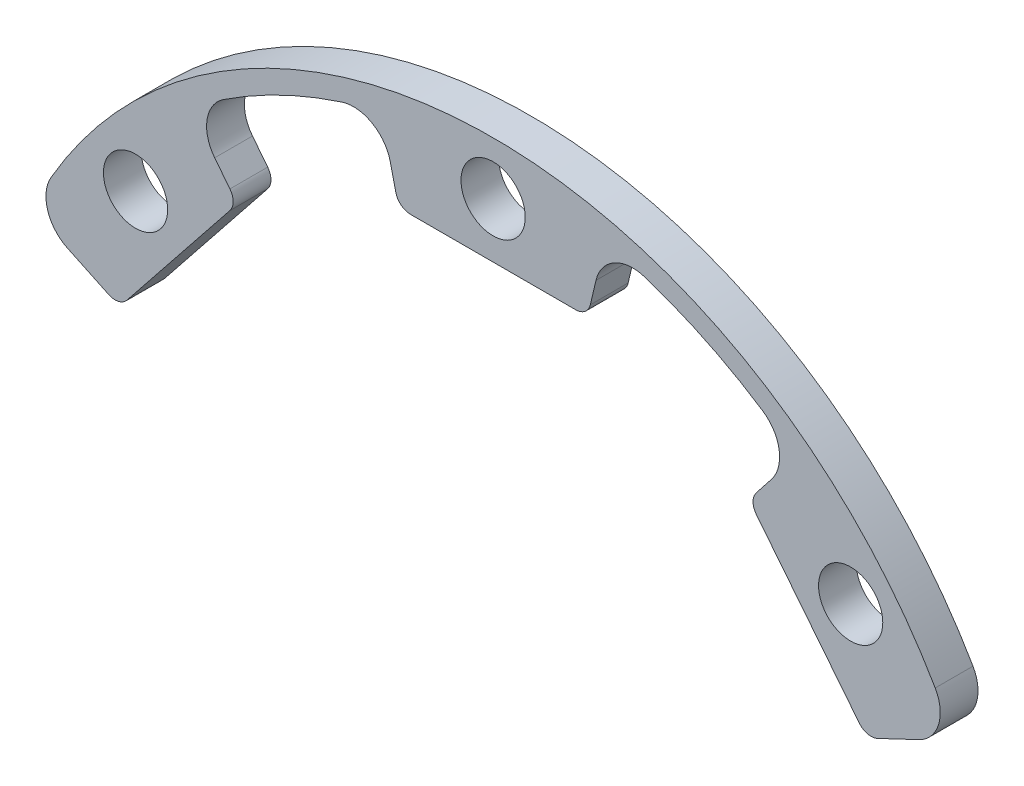
ISO-10303-21;
HEADER;
FILE_DESCRIPTION(('STEP AP214'),'2;1');
FILE_NAME('part.step','',(''),(''),'','','');
FILE_SCHEMA(('AUTOMOTIVE_DESIGN { 1 0 10303 214 1 1 1 1 }'));
ENDSEC;
DATA;
#1=APPLICATION_CONTEXT('core data for automotive mechanical design processes');
#2=APPLICATION_PROTOCOL_DEFINITION('international standard','automotive_design',2000,#1);
#3=PRODUCT_CONTEXT('',#1,'mechanical');
#4=PRODUCT('Part','Part','',(#3));
#5=PRODUCT_RELATED_PRODUCT_CATEGORY('part','',(#4));
#6=PRODUCT_DEFINITION_FORMATION('','',#4);
#7=PRODUCT_DEFINITION_CONTEXT('part definition',#1,'design');
#8=PRODUCT_DEFINITION('design','',#6,#7);
#9=PRODUCT_DEFINITION_SHAPE('','',#8);
#10=(LENGTH_UNIT() NAMED_UNIT(*) SI_UNIT(.MILLI.,.METRE.));
#11=(NAMED_UNIT(*) PLANE_ANGLE_UNIT() SI_UNIT($,.RADIAN.));
#12=(NAMED_UNIT(*) SI_UNIT($,.STERADIAN.) SOLID_ANGLE_UNIT());
#13=UNCERTAINTY_MEASURE_WITH_UNIT(LENGTH_MEASURE(1.E-05),#10,'distance_accuracy_value','');
#14=(GEOMETRIC_REPRESENTATION_CONTEXT(3) GLOBAL_UNCERTAINTY_ASSIGNED_CONTEXT((#13)) GLOBAL_UNIT_ASSIGNED_CONTEXT((#10,
#11,#12)) REPRESENTATION_CONTEXT('',''));
#15=CARTESIAN_POINT('',(0.,0.,0.));
#16=DIRECTION('',(0.,0.,1.));
#17=DIRECTION('',(1.,0.,0.));
#18=AXIS2_PLACEMENT_3D('',#15,#16,#17);
#19=CARTESIAN_POINT('',(0.,0.,5.));
#20=DIRECTION('',(0.,0.,-1.));
#21=DIRECTION('',(-1.,0.,0.));
#22=AXIS2_PLACEMENT_3D('',#19,#20,#21);
#23=CYLINDRICAL_SURFACE('',#22,67.5);
#24=CARTESIAN_POINT('',(0.,0.,5.));
#25=DIRECTION('',(0.,0.,1.));
#26=DIRECTION('',(1.,0.,0.));
#27=AXIS2_PLACEMENT_3D('',#24,#25,#26);
#28=CIRCLE('',#27,67.5);
#29=CARTESIAN_POINT('',(-58.4869884798943,33.6975099755562,5.));
#30=VERTEX_POINT('',#29);
#31=CARTESIAN_POINT('',(58.4869884798943,33.6975099755562,5.));
#32=VERTEX_POINT('',#31);
#33=EDGE_CURVE('E258',#30,#32,#28,.F.);
#34=ORIENTED_EDGE('',*,*,#33,.T.);
#35=DIRECTION('',(0.,0.,-1.));
#36=VECTOR('',#35,1.);
#37=CARTESIAN_POINT('',(58.4869884798943,33.6975099755562,5.));
#38=LINE('',#37,#36);
#39=CARTESIAN_POINT('',(58.4869884798943,33.6975099755562,0.));
#40=VERTEX_POINT('',#39);
#41=EDGE_CURVE('E278',#32,#40,#38,.T.);
#42=ORIENTED_EDGE('',*,*,#41,.T.);
#43=CARTESIAN_POINT('',(0.,0.,0.));
#44=DIRECTION('',(0.,0.,1.));
#45=DIRECTION('',(1.,0.,0.));
#46=AXIS2_PLACEMENT_3D('',#43,#44,#45);
#47=CIRCLE('',#46,67.5);
#48=CARTESIAN_POINT('',(-58.4869884798943,33.6975099755562,0.));
#49=VERTEX_POINT('',#48);
#50=EDGE_CURVE('E384',#49,#40,#47,.F.);
#51=ORIENTED_EDGE('',*,*,#50,.F.);
#52=DIRECTION('',(0.,0.,-1.));
#53=VECTOR('',#52,1.);
#54=CARTESIAN_POINT('',(-58.4869884798943,33.6975099755562,5.));
#55=LINE('',#54,#53);
#56=EDGE_CURVE('E276',#49,#30,#55,.F.);
#57=ORIENTED_EDGE('',*,*,#56,.T.);
#58=EDGE_LOOP('',(#34,#42,#51,#57));
#59=FACE_BOUND('',#58,.T.);
#60=ADVANCED_FACE('F35',(#59),#23,.T.);
#61=CARTESIAN_POINT('',(0.,0.,5.));
#62=DIRECTION('',(-0.428304381921088,-0.903634525915868,0.));
#63=DIRECTION('',(0.903634525915868,-0.428304381921088,0.));
#64=AXIS2_PLACEMENT_3D('',#61,#62,#63);
#65=PLANE('',#64);
#66=DIRECTION('',(-0.903634525915868,0.428304381921088,0.));
#67=VECTOR('',#66,1.);
#68=CARTESIAN_POINT('',(0.,0.,0.));
#69=LINE('',#68,#67);
#70=CARTESIAN_POINT('',(-50.8588287102896,24.1060501466709,0.));
#71=VERTEX_POINT('',#70);
#72=CARTESIAN_POINT('',(-56.2961408724706,26.6832254959356,0.));
#73=VERTEX_POINT('',#72);
#74=EDGE_CURVE('E383',#71,#73,#69,.T.);
#75=ORIENTED_EDGE('',*,*,#74,.F.);
#76=DIRECTION('',(0.,0.,-1.));
#77=VECTOR('',#76,1.);
#78=CARTESIAN_POINT('',(-50.8588287102896,24.1060501466709,5.));
#79=LINE('',#78,#77);
#80=CARTESIAN_POINT('',(-50.8588287102896,24.1060501466709,5.));
#81=VERTEX_POINT('',#80);
#82=EDGE_CURVE('E11',#71,#81,#79,.F.);
#83=ORIENTED_EDGE('',*,*,#82,.T.);
#84=DIRECTION('',(-0.903634525915868,0.428304381921088,0.));
#85=VECTOR('',#84,1.);
#86=CARTESIAN_POINT('',(0.,0.,5.));
#87=LINE('',#86,#85);
#88=CARTESIAN_POINT('',(-56.2961408724706,26.6832254959356,5.));
#89=VERTEX_POINT('',#88);
#90=EDGE_CURVE('E376',#81,#89,#87,.T.);
#91=ORIENTED_EDGE('',*,*,#90,.T.);
#92=DIRECTION('',(0.,0.,-1.));
#93=VECTOR('',#92,1.);
#94=CARTESIAN_POINT('',(-56.2961408724706,26.6832254959356,5.));
#95=LINE('',#94,#93);
#96=EDGE_CURVE('E209',#89,#73,#95,.T.);
#97=ORIENTED_EDGE('',*,*,#96,.T.);
#98=EDGE_LOOP('',(#75,#83,#91,#97));
#99=FACE_BOUND('',#98,.T.);
#100=ADVANCED_FACE('F433',(#99),#65,.T.);
#101=CARTESIAN_POINT('',(-41.6325264414226,33.2008319489776,5.));
#102=DIRECTION('',(-0.78183148246803,0.623489801858734,0.));
#103=DIRECTION('',(-0.623489801858734,-0.78183148246803,0.));
#104=AXIS2_PLACEMENT_3D('',#101,#102,#103);
#105=PLANE('',#104);
#106=DIRECTION('',(0.623489801858734,0.78183148246803,0.));
#107=VECTOR('',#106,1.);
#108=CARTESIAN_POINT('',(-41.6325264414226,33.2008319489776,0.));
#109=LINE('',#108,#107);
#110=CARTESIAN_POINT('',(-48.4385569815114,24.6663395947851,0.));
#111=VERTEX_POINT('',#110);
#112=CARTESIAN_POINT('',(-34.8246984129672,41.737578282289,0.));
#113=VERTEX_POINT('',#112);
#114=EDGE_CURVE('E231',#111,#113,#109,.T.);
#115=ORIENTED_EDGE('',*,*,#114,.T.);
#116=DIRECTION('',(0.,0.,-1.));
#117=VECTOR('',#116,1.);
#118=CARTESIAN_POINT('',(-34.8246984129672,41.737578282289,5.));
#119=LINE('',#118,#117);
#120=CARTESIAN_POINT('',(-34.8246984129672,41.737578282289,5.));
#121=VERTEX_POINT('',#120);
#122=EDGE_CURVE('E43',#113,#121,#119,.F.);
#123=ORIENTED_EDGE('',*,*,#122,.T.);
#124=DIRECTION('',(0.623489801858734,0.78183148246803,0.));
#125=VECTOR('',#124,1.);
#126=CARTESIAN_POINT('',(-41.6325264414226,33.2008319489776,5.));
#127=LINE('',#126,#125);
#128=CARTESIAN_POINT('',(-48.4385569815114,24.6663395947851,5.));
#129=VERTEX_POINT('',#128);
#130=EDGE_CURVE('E364',#129,#121,#127,.T.);
#131=ORIENTED_EDGE('',*,*,#130,.F.);
#132=DIRECTION('',(0.,0.,-1.));
#133=VECTOR('',#132,1.);
#134=CARTESIAN_POINT('',(-48.4385569815114,24.6663395947851,0.));
#135=LINE('',#134,#133);
#136=EDGE_CURVE('E356',#129,#111,#135,.T.);
#137=ORIENTED_EDGE('',*,*,#136,.T.);
#138=EDGE_LOOP('',(#115,#123,#131,#137));
#139=FACE_BOUND('',#138,.T.);
#140=ADVANCED_FACE('F363',(#139),#105,.F.);
#141=CARTESIAN_POINT('',(0.,0.,5.));
#142=DIRECTION('',(-0.785702679283874,-0.618604315993788,0.));
#143=DIRECTION('',(0.618604315993788,-0.785702679283874,0.));
#144=AXIS2_PLACEMENT_3D('',#141,#142,#143);
#145=PLANE('',#144);
#146=DIRECTION('',(-0.618604315993788,0.785702679283874,0.));
#147=VECTOR('',#146,1.);
#148=CARTESIAN_POINT('',(0.,0.,5.));
#149=LINE('',#148,#147);
#150=CARTESIAN_POINT('',(-34.8169560193356,44.2217665179941,5.));
#151=VERTEX_POINT('',#150);
#152=CARTESIAN_POINT('',(-36.8319653918605,46.7810733670444,5.));
#153=VERTEX_POINT('',#152);
#154=EDGE_CURVE('E375',#151,#153,#149,.T.);
#155=ORIENTED_EDGE('',*,*,#154,.F.);
#156=DIRECTION('',(0.,0.,-1.));
#157=VECTOR('',#156,1.);
#158=CARTESIAN_POINT('',(-34.8169560193356,44.2217665179941,5.));
#159=LINE('',#158,#157);
#160=CARTESIAN_POINT('',(-34.8169560193356,44.2217665179941,0.));
#161=VERTEX_POINT('',#160);
#162=EDGE_CURVE('E353',#151,#161,#159,.T.);
#163=ORIENTED_EDGE('',*,*,#162,.T.);
#164=DIRECTION('',(-0.618604315993788,0.785702679283874,0.));
#165=VECTOR('',#164,1.);
#166=CARTESIAN_POINT('',(0.,0.,0.));
#167=LINE('',#166,#165);
#168=CARTESIAN_POINT('',(-36.8319653918605,46.7810733670444,0.));
#169=VERTEX_POINT('',#168);
#170=EDGE_CURVE('E227',#161,#169,#167,.T.);
#171=ORIENTED_EDGE('',*,*,#170,.T.);
#172=DIRECTION('',(0.,0.,1.));
#173=VECTOR('',#172,1.);
#174=CARTESIAN_POINT('',(-36.8319653918605,46.7810733670444,5.));
#175=LINE('',#174,#173);
#176=EDGE_CURVE('E204',#169,#153,#175,.T.);
#177=ORIENTED_EDGE('',*,*,#176,.T.);
#178=EDGE_LOOP('',(#155,#163,#171,#177));
#179=FACE_BOUND('',#178,.T.);
#180=ADVANCED_FACE('F381',(#179),#145,.F.);
#181=CARTESIAN_POINT('',(0.,0.,5.));
#182=DIRECTION('',(0.,0.,-1.));
#183=DIRECTION('',(-1.,0.,0.));
#184=AXIS2_PLACEMENT_3D('',#181,#182,#183);
#185=CYLINDRICAL_SURFACE('',#184,64.75);
#186=CARTESIAN_POINT('',(0.,0.,5.));
#187=DIRECTION('',(0.,0.,1.));
#188=DIRECTION('',(1.,0.,0.));
#189=AXIS2_PLACEMENT_3D('',#186,#187,#188);
#190=CIRCLE('',#189,64.75);
#191=CARTESIAN_POINT('',(-35.6568789406664,54.0476593777257,5.));
#192=VERTEX_POINT('',#191);
#193=CARTESIAN_POINT('',(-20.0244612695975,61.5758349587108,5.));
#194=VERTEX_POINT('',#193);
#195=EDGE_CURVE('E218',#192,#194,#190,.F.);
#196=ORIENTED_EDGE('',*,*,#195,.F.);
#197=DIRECTION('',(0.,0.,-1.));
#198=VECTOR('',#197,1.);
#199=CARTESIAN_POINT('',(-35.6568789406664,54.0476593777257,5.));
#200=LINE('',#199,#198);
#201=CARTESIAN_POINT('',(-35.6568789406664,54.0476593777257,0.));
#202=VERTEX_POINT('',#201);
#203=EDGE_CURVE('E202',#192,#202,#200,.T.);
#204=ORIENTED_EDGE('',*,*,#203,.T.);
#205=CARTESIAN_POINT('',(0.,0.,0.));
#206=DIRECTION('',(0.,0.,1.));
#207=DIRECTION('',(1.,0.,0.));
#208=AXIS2_PLACEMENT_3D('',#205,#206,#207);
#209=CIRCLE('',#208,64.75);
#210=CARTESIAN_POINT('',(-20.0244612695975,61.5758349587108,0.));
#211=VERTEX_POINT('',#210);
#212=EDGE_CURVE('E215',#202,#211,#209,.F.);
#213=ORIENTED_EDGE('',*,*,#212,.T.);
#214=DIRECTION('',(0.,0.,-1.));
#215=VECTOR('',#214,1.);
#216=CARTESIAN_POINT('',(-20.0244612695975,61.5758349587108,5.));
#217=LINE('',#216,#215);
#218=EDGE_CURVE('E219',#211,#194,#217,.F.);
#219=ORIENTED_EDGE('',*,*,#218,.T.);
#220=EDGE_LOOP('',(#196,#204,#213,#219));
#221=FACE_BOUND('',#220,.T.);
#222=ADVANCED_FACE('F214',(#221),#185,.F.);
#223=CARTESIAN_POINT('',(0.,0.,5.));
#224=DIRECTION('',(-0.973521937261123,-0.228593608115689,0.));
#225=DIRECTION('',(0.228593608115689,-0.973521937261123,0.));
#226=AXIS2_PLACEMENT_3D('',#223,#224,#225);
#227=PLANE('',#226);
#228=DIRECTION('',(-0.228593608115689,0.973521937261124,0.));
#229=VECTOR('',#228,1.);
#230=CARTESIAN_POINT('',(0.,0.,0.));
#231=LINE('',#230,#229);
#232=CARTESIAN_POINT('',(-12.8659522642986,54.7928127837686,0.));
#233=VERTEX_POINT('',#232);
#234=CARTESIAN_POINT('',(-13.6105611377631,57.9639122688869,0.));
#235=VERTEX_POINT('',#234);
#236=EDGE_CURVE('E226',#233,#235,#231,.T.);
#237=ORIENTED_EDGE('',*,*,#236,.F.);
#238=DIRECTION('',(0.,0.,-1.));
#239=VECTOR('',#238,1.);
#240=CARTESIAN_POINT('',(-12.8659522642986,54.7928127837686,5.));
#241=LINE('',#240,#239);
#242=CARTESIAN_POINT('',(-12.8659522642986,54.7928127837686,5.));
#243=VERTEX_POINT('',#242);
#244=EDGE_CURVE('E351',#233,#243,#241,.F.);
#245=ORIENTED_EDGE('',*,*,#244,.T.);
#246=DIRECTION('',(-0.228593608115689,0.973521937261124,0.));
#247=VECTOR('',#246,1.);
#248=CARTESIAN_POINT('',(0.,0.,5.));
#249=LINE('',#248,#247);
#250=CARTESIAN_POINT('',(-13.6105611377631,57.9639122688869,5.));
#251=VERTEX_POINT('',#250);
#252=EDGE_CURVE('E410',#243,#251,#249,.T.);
#253=ORIENTED_EDGE('',*,*,#252,.T.);
#254=DIRECTION('',(0.,0.,-1.));
#255=VECTOR('',#254,1.);
#256=CARTESIAN_POINT('',(-13.6105611377631,57.9639122688869,5.));
#257=LINE('',#256,#255);
#258=EDGE_CURVE('E262',#251,#235,#257,.T.);
#259=ORIENTED_EDGE('',*,*,#258,.T.);
#260=EDGE_LOOP('',(#237,#245,#253,#259));
#261=FACE_BOUND('',#260,.T.);
#262=ADVANCED_FACE('F593',(#261),#227,.T.);
#263=CARTESIAN_POINT('',(0.,53.25,5.));
#264=DIRECTION('',(0.,1.,0.));
#265=DIRECTION('',(0.,0.,1.));
#266=AXIS2_PLACEMENT_3D('',#263,#264,#265);
#267=PLANE('',#266);
#268=DIRECTION('',(1.,0.,0.));
#269=VECTOR('',#268,1.);
#270=CARTESIAN_POINT('',(0.,53.25,0.));
#271=LINE('',#270,#269);
#272=CARTESIAN_POINT('',(-10.9189083897764,53.25,0.));
#273=VERTEX_POINT('',#272);
#274=CARTESIAN_POINT('',(10.9189083897764,53.25,0.));
#275=VERTEX_POINT('',#274);
#276=EDGE_CURVE('E229',#273,#275,#271,.T.);
#277=ORIENTED_EDGE('',*,*,#276,.T.);
#278=DIRECTION('',(0.,0.,-1.));
#279=VECTOR('',#278,1.);
#280=CARTESIAN_POINT('',(10.9189083897764,53.25,5.));
#281=LINE('',#280,#279);
#282=CARTESIAN_POINT('',(10.9189083897764,53.25,5.));
#283=VERTEX_POINT('',#282);
#284=EDGE_CURVE('E349',#275,#283,#281,.F.);
#285=ORIENTED_EDGE('',*,*,#284,.T.);
#286=DIRECTION('',(1.,0.,0.));
#287=VECTOR('',#286,1.);
#288=CARTESIAN_POINT('',(0.,53.25,5.));
#289=LINE('',#288,#287);
#290=CARTESIAN_POINT('',(-10.9189083897764,53.25,5.));
#291=VERTEX_POINT('',#290);
#292=EDGE_CURVE('E408',#291,#283,#289,.T.);
#293=ORIENTED_EDGE('',*,*,#292,.F.);
#294=DIRECTION('',(0.,0.,-1.));
#295=VECTOR('',#294,1.);
#296=CARTESIAN_POINT('',(-10.9189083897764,53.25,0.));
#297=LINE('',#296,#295);
#298=EDGE_CURVE('E346',#291,#273,#297,.T.);
#299=ORIENTED_EDGE('',*,*,#298,.T.);
#300=EDGE_LOOP('',(#277,#285,#293,#299));
#301=FACE_BOUND('',#300,.T.);
#302=ADVANCED_FACE('F583',(#301),#267,.F.);
#303=CARTESIAN_POINT('',(0.,0.,5.));
#304=DIRECTION('',(-0.973521937261123,0.228593608115689,0.));
#305=DIRECTION('',(-0.228593608115689,-0.973521937261123,0.));
#306=AXIS2_PLACEMENT_3D('',#303,#304,#305);
#307=PLANE('',#306);
#308=DIRECTION('',(0.228593608115689,0.973521937261124,0.));
#309=VECTOR('',#308,1.);
#310=CARTESIAN_POINT('',(0.,0.,5.));
#311=LINE('',#310,#309);
#312=CARTESIAN_POINT('',(12.8659522642986,54.7928127837686,5.));
#313=VERTEX_POINT('',#312);
#314=CARTESIAN_POINT('',(13.6105611377631,57.9639122688869,5.));
#315=VERTEX_POINT('',#314);
#316=EDGE_CURVE('E406',#313,#315,#311,.T.);
#317=ORIENTED_EDGE('',*,*,#316,.F.);
#318=DIRECTION('',(0.,0.,-1.));
#319=VECTOR('',#318,1.);
#320=CARTESIAN_POINT('',(12.8659522642986,54.7928127837686,5.));
#321=LINE('',#320,#319);
#322=CARTESIAN_POINT('',(12.8659522642986,54.7928127837686,0.));
#323=VERTEX_POINT('',#322);
#324=EDGE_CURVE('E343',#313,#323,#321,.T.);
#325=ORIENTED_EDGE('',*,*,#324,.T.);
#326=DIRECTION('',(0.228593608115689,0.973521937261124,0.));
#327=VECTOR('',#326,1.);
#328=CARTESIAN_POINT('',(0.,0.,0.));
#329=LINE('',#328,#327);
#330=CARTESIAN_POINT('',(13.6105611377631,57.9639122688869,0.));
#331=VERTEX_POINT('',#330);
#332=EDGE_CURVE('E237',#323,#331,#329,.T.);
#333=ORIENTED_EDGE('',*,*,#332,.T.);
#334=DIRECTION('',(0.,0.,1.));
#335=VECTOR('',#334,1.);
#336=CARTESIAN_POINT('',(13.6105611377631,57.9639122688869,5.));
#337=LINE('',#336,#335);
#338=EDGE_CURVE('E270',#331,#315,#337,.T.);
#339=ORIENTED_EDGE('',*,*,#338,.T.);
#340=EDGE_LOOP('',(#317,#325,#333,#339));
#341=FACE_BOUND('',#340,.T.);
#342=ADVANCED_FACE('F578',(#341),#307,.F.);
#343=CARTESIAN_POINT('',(0.,0.,5.));
#344=DIRECTION('',(0.,0.,-1.));
#345=DIRECTION('',(-1.,0.,0.));
#346=AXIS2_PLACEMENT_3D('',#343,#344,#345);
#347=CYLINDRICAL_SURFACE('',#346,64.75);
#348=CARTESIAN_POINT('',(0.,0.,5.));
#349=DIRECTION('',(0.,0.,1.));
#350=DIRECTION('',(1.,0.,0.));
#351=AXIS2_PLACEMENT_3D('',#348,#349,#350);
#352=CIRCLE('',#351,64.75);
#353=CARTESIAN_POINT('',(20.0244612695975,61.5758349587108,5.));
#354=VERTEX_POINT('',#353);
#355=CARTESIAN_POINT('',(35.6568789406664,54.0476593777257,5.));
#356=VERTEX_POINT('',#355);
#357=EDGE_CURVE('E403',#354,#356,#352,.F.);
#358=ORIENTED_EDGE('',*,*,#357,.F.);
#359=DIRECTION('',(0.,0.,-1.));
#360=VECTOR('',#359,1.);
#361=CARTESIAN_POINT('',(20.0244612695975,61.5758349587108,5.));
#362=LINE('',#361,#360);
#363=CARTESIAN_POINT('',(20.0244612695975,61.5758349587108,0.));
#364=VERTEX_POINT('',#363);
#365=EDGE_CURVE('E267',#354,#364,#362,.T.);
#366=ORIENTED_EDGE('',*,*,#365,.T.);
#367=CARTESIAN_POINT('',(0.,0.,0.));
#368=DIRECTION('',(0.,0.,1.));
#369=DIRECTION('',(1.,0.,0.));
#370=AXIS2_PLACEMENT_3D('',#367,#368,#369);
#371=CIRCLE('',#370,64.75);
#372=CARTESIAN_POINT('',(35.6568789406664,54.0476593777257,0.));
#373=VERTEX_POINT('',#372);
#374=EDGE_CURVE('E239',#364,#373,#371,.F.);
#375=ORIENTED_EDGE('',*,*,#374,.T.);
#376=DIRECTION('',(0.,0.,-1.));
#377=VECTOR('',#376,1.);
#378=CARTESIAN_POINT('',(35.6568789406664,54.0476593777257,5.));
#379=LINE('',#378,#377);
#380=EDGE_CURVE('E265',#373,#356,#379,.F.);
#381=ORIENTED_EDGE('',*,*,#380,.T.);
#382=EDGE_LOOP('',(#358,#366,#375,#381));
#383=FACE_BOUND('',#382,.T.);
#384=ADVANCED_FACE('F571',(#383),#347,.F.);
#385=CARTESIAN_POINT('',(0.,0.,5.));
#386=DIRECTION('',(-0.785702679283874,0.618604315993788,0.));
#387=DIRECTION('',(-0.618604315993788,-0.785702679283874,0.));
#388=AXIS2_PLACEMENT_3D('',#385,#386,#387);
#389=PLANE('',#388);
#390=DIRECTION('',(0.618604315993788,0.785702679283874,0.));
#391=VECTOR('',#390,1.);
#392=CARTESIAN_POINT('',(0.,0.,0.));
#393=LINE('',#392,#391);
#394=CARTESIAN_POINT('',(34.8169560193356,44.2217665179941,0.));
#395=VERTEX_POINT('',#394);
#396=CARTESIAN_POINT('',(36.8319653918605,46.7810733670444,0.));
#397=VERTEX_POINT('',#396);
#398=EDGE_CURVE('E242',#395,#397,#393,.T.);
#399=ORIENTED_EDGE('',*,*,#398,.F.);
#400=DIRECTION('',(0.,0.,-1.));
#401=VECTOR('',#400,1.);
#402=CARTESIAN_POINT('',(34.8169560193356,44.2217665179941,5.));
#403=LINE('',#402,#401);
#404=CARTESIAN_POINT('',(34.8169560193356,44.2217665179941,5.));
#405=VERTEX_POINT('',#404);
#406=EDGE_CURVE('E50',#395,#405,#403,.F.);
#407=ORIENTED_EDGE('',*,*,#406,.T.);
#408=DIRECTION('',(0.618604315993788,0.785702679283874,0.));
#409=VECTOR('',#408,1.);
#410=CARTESIAN_POINT('',(0.,0.,5.));
#411=LINE('',#410,#409);
#412=CARTESIAN_POINT('',(36.8319653918605,46.7810733670444,5.));
#413=VERTEX_POINT('',#412);
#414=EDGE_CURVE('E401',#405,#413,#411,.T.);
#415=ORIENTED_EDGE('',*,*,#414,.T.);
#416=DIRECTION('',(0.,0.,-1.));
#417=VECTOR('',#416,1.);
#418=CARTESIAN_POINT('',(36.8319653918605,46.7810733670444,5.));
#419=LINE('',#418,#417);
#420=EDGE_CURVE('E273',#413,#397,#419,.T.);
#421=ORIENTED_EDGE('',*,*,#420,.T.);
#422=EDGE_LOOP('',(#399,#407,#415,#421));
#423=FACE_BOUND('',#422,.T.);
#424=ADVANCED_FACE('F559',(#423),#389,.T.);
#425=CARTESIAN_POINT('',(41.6325264414226,33.2008319489776,5.));
#426=DIRECTION('',(0.78183148246803,0.623489801858734,0.));
#427=DIRECTION('',(-0.623489801858734,0.78183148246803,0.));
#428=AXIS2_PLACEMENT_3D('',#425,#426,#427);
#429=PLANE('',#428);
#430=DIRECTION('',(0.623489801858734,-0.78183148246803,0.));
#431=VECTOR('',#430,1.);
#432=CARTESIAN_POINT('',(41.6325264414226,33.2008319489776,0.));
#433=LINE('',#432,#431);
#434=CARTESIAN_POINT('',(34.8246984129672,41.737578282289,0.));
#435=VERTEX_POINT('',#434);
#436=CARTESIAN_POINT('',(48.4385569815114,24.6663395947852,0.));
#437=VERTEX_POINT('',#436);
#438=EDGE_CURVE('E244',#435,#437,#433,.T.);
#439=ORIENTED_EDGE('',*,*,#438,.T.);
#440=DIRECTION('',(0.,0.,-1.));
#441=VECTOR('',#440,1.);
#442=CARTESIAN_POINT('',(48.4385569815114,24.6663395947852,5.));
#443=LINE('',#442,#441);
#444=CARTESIAN_POINT('',(48.4385569815114,24.6663395947852,5.));
#445=VERTEX_POINT('',#444);
#446=EDGE_CURVE('E329',#437,#445,#443,.F.);
#447=ORIENTED_EDGE('',*,*,#446,.T.);
#448=DIRECTION('',(0.623489801858734,-0.78183148246803,0.));
#449=VECTOR('',#448,1.);
#450=CARTESIAN_POINT('',(41.6325264414226,33.2008319489776,5.));
#451=LINE('',#450,#449);
#452=CARTESIAN_POINT('',(34.8246984129672,41.737578282289,5.));
#453=VERTEX_POINT('',#452);
#454=EDGE_CURVE('E399',#453,#445,#451,.T.);
#455=ORIENTED_EDGE('',*,*,#454,.F.);
#456=DIRECTION('',(0.,0.,-1.));
#457=VECTOR('',#456,1.);
#458=CARTESIAN_POINT('',(34.8246984129672,41.737578282289,0.));
#459=LINE('',#458,#457);
#460=EDGE_CURVE('E326',#453,#435,#459,.T.);
#461=ORIENTED_EDGE('',*,*,#460,.T.);
#462=EDGE_LOOP('',(#439,#447,#455,#461));
#463=FACE_BOUND('',#462,.T.);
#464=ADVANCED_FACE('F553',(#463),#429,.F.);
#465=CARTESIAN_POINT('',(0.,60.5,5.));
#466=DIRECTION('',(0.,0.,-1.));
#467=DIRECTION('',(-1.,0.,0.));
#468=AXIS2_PLACEMENT_3D('',#465,#466,#467);
#469=CYLINDRICAL_SURFACE('',#468,4.25);
#470=CARTESIAN_POINT('',(0.,60.5,5.));
#471=DIRECTION('',(0.,0.,1.));
#472=DIRECTION('',(1.,0.,0.));
#473=AXIS2_PLACEMENT_3D('',#470,#471,#472);
#474=CIRCLE('',#473,4.25);
#475=CARTESIAN_POINT('',(4.25,60.5,5.));
#476=VERTEX_POINT('',#475);
#477=EDGE_CURVE('E391',#476,#476,#474,.T.);
#478=ORIENTED_EDGE('',*,*,#477,.T.);
#479=EDGE_LOOP('',(#478));
#480=FACE_BOUND('',#479,.T.);
#481=CARTESIAN_POINT('',(0.,60.5,0.));
#482=DIRECTION('',(0.,0.,1.));
#483=DIRECTION('',(1.,0.,0.));
#484=AXIS2_PLACEMENT_3D('',#481,#482,#483);
#485=CIRCLE('',#484,4.25);
#486=CARTESIAN_POINT('',(4.25,60.5,0.));
#487=VERTEX_POINT('',#486);
#488=EDGE_CURVE('E252',#487,#487,#485,.T.);
#489=ORIENTED_EDGE('',*,*,#488,.F.);
#490=EDGE_LOOP('',(#489));
#491=FACE_BOUND('',#490,.T.);
#492=ADVANCED_FACE('F558',(#480,#491),#469,.F.);
#493=CARTESIAN_POINT('',(-47.3008046893158,37.7211330124534,5.));
#494=DIRECTION('',(0.,0.,-1.));
#495=DIRECTION('',(-1.,0.,0.));
#496=AXIS2_PLACEMENT_3D('',#493,#494,#495);
#497=CYLINDRICAL_SURFACE('',#496,4.25);
#498=CARTESIAN_POINT('',(-47.3008046893158,37.7211330124534,5.));
#499=DIRECTION('',(0.,0.,1.));
#500=DIRECTION('',(1.,0.,0.));
#501=AXIS2_PLACEMENT_3D('',#498,#499,#500);
#502=CIRCLE('',#501,4.25);
#503=CARTESIAN_POINT('',(-43.0508046893158,37.7211330124534,5.));
#504=VERTEX_POINT('',#503);
#505=EDGE_CURVE('E394',#504,#504,#502,.T.);
#506=ORIENTED_EDGE('',*,*,#505,.T.);
#507=EDGE_LOOP('',(#506));
#508=FACE_BOUND('',#507,.T.);
#509=CARTESIAN_POINT('',(-47.3008046893158,37.7211330124534,0.));
#510=DIRECTION('',(0.,0.,1.));
#511=DIRECTION('',(1.,0.,0.));
#512=AXIS2_PLACEMENT_3D('',#509,#510,#511);
#513=CIRCLE('',#512,4.25);
#514=CARTESIAN_POINT('',(-43.0508046893158,37.7211330124534,0.));
#515=VERTEX_POINT('',#514);
#516=EDGE_CURVE('E249',#515,#515,#513,.T.);
#517=ORIENTED_EDGE('',*,*,#516,.F.);
#518=EDGE_LOOP('',(#517));
#519=FACE_BOUND('',#518,.T.);
#520=ADVANCED_FACE('F544',(#508,#519),#497,.F.);
#521=CARTESIAN_POINT('',(0.,0.,5.));
#522=DIRECTION('',(-0.428304381921088,0.903634525915868,0.));
#523=DIRECTION('',(-0.903634525915868,-0.428304381921088,0.));
#524=AXIS2_PLACEMENT_3D('',#521,#522,#523);
#525=PLANE('',#524);
#526=DIRECTION('',(0.903634525915868,0.428304381921088,0.));
#527=VECTOR('',#526,1.);
#528=CARTESIAN_POINT('',(0.,0.,5.));
#529=LINE('',#528,#527);
#530=CARTESIAN_POINT('',(50.8588287102896,24.1060501466709,5.));
#531=VERTEX_POINT('',#530);
#532=CARTESIAN_POINT('',(56.2961408724706,26.6832254959357,5.));
#533=VERTEX_POINT('',#532);
#534=EDGE_CURVE('E397',#531,#533,#529,.T.);
#535=ORIENTED_EDGE('',*,*,#534,.F.);
#536=DIRECTION('',(0.,0.,-1.));
#537=VECTOR('',#536,1.);
#538=CARTESIAN_POINT('',(50.8588287102896,24.1060501466709,5.));
#539=LINE('',#538,#537);
#540=CARTESIAN_POINT('',(50.8588287102896,24.1060501466709,0.));
#541=VERTEX_POINT('',#540);
#542=EDGE_CURVE('E311',#531,#541,#539,.T.);
#543=ORIENTED_EDGE('',*,*,#542,.T.);
#544=DIRECTION('',(0.903634525915868,0.428304381921088,0.));
#545=VECTOR('',#544,1.);
#546=CARTESIAN_POINT('',(0.,0.,0.));
#547=LINE('',#546,#545);
#548=CARTESIAN_POINT('',(56.2961408724706,26.6832254959357,0.));
#549=VERTEX_POINT('',#548);
#550=EDGE_CURVE('E247',#541,#549,#547,.T.);
#551=ORIENTED_EDGE('',*,*,#550,.T.);
#552=DIRECTION('',(0.,0.,1.));
#553=VECTOR('',#552,1.);
#554=CARTESIAN_POINT('',(56.2961408724706,26.6832254959357,5.));
#555=LINE('',#554,#553);
#556=EDGE_CURVE('E286',#549,#533,#555,.T.);
#557=ORIENTED_EDGE('',*,*,#556,.T.);
#558=EDGE_LOOP('',(#535,#543,#551,#557));
#559=FACE_BOUND('',#558,.T.);
#560=ADVANCED_FACE('F539',(#559),#525,.F.);
#561=CARTESIAN_POINT('',(47.3008046893158,37.7211330124534,5.));
#562=DIRECTION('',(0.,0.,-1.));
#563=DIRECTION('',(-1.,0.,0.));
#564=AXIS2_PLACEMENT_3D('',#561,#562,#563);
#565=CYLINDRICAL_SURFACE('',#564,4.25);
#566=CARTESIAN_POINT('',(47.3008046893158,37.7211330124534,5.));
#567=DIRECTION('',(0.,0.,1.));
#568=DIRECTION('',(1.,0.,0.));
#569=AXIS2_PLACEMENT_3D('',#566,#567,#568);
#570=CIRCLE('',#569,4.25);
#571=CARTESIAN_POINT('',(51.5508046893158,37.7211330124534,5.));
#572=VERTEX_POINT('',#571);
#573=EDGE_CURVE('E259',#572,#572,#570,.T.);
#574=ORIENTED_EDGE('',*,*,#573,.T.);
#575=EDGE_LOOP('',(#574));
#576=FACE_BOUND('',#575,.T.);
#577=CARTESIAN_POINT('',(47.3008046893158,37.7211330124534,0.));
#578=DIRECTION('',(0.,0.,1.));
#579=DIRECTION('',(1.,0.,0.));
#580=AXIS2_PLACEMENT_3D('',#577,#578,#579);
#581=CIRCLE('',#580,4.25);
#582=CARTESIAN_POINT('',(51.5508046893158,37.7211330124534,0.));
#583=VERTEX_POINT('',#582);
#584=EDGE_CURVE('E255',#583,#583,#581,.T.);
#585=ORIENTED_EDGE('',*,*,#584,.F.);
#586=EDGE_LOOP('',(#585));
#587=FACE_BOUND('',#586,.T.);
#588=ADVANCED_FACE('F531',(#576,#587),#565,.F.);
#589=CARTESIAN_POINT('',(0.,0.,5.));
#590=DIRECTION('',(0.,0.,1.));
#591=DIRECTION('',(1.,0.,0.));
#592=AXIS2_PLACEMENT_3D('',#589,#590,#591);
#593=PLANE('',#592);
#594=ORIENTED_EDGE('',*,*,#454,.T.);
#595=CARTESIAN_POINT('',(50.0022199464474,25.9133191985026,5.));
#596=DIRECTION('',(0.,0.,1.));
#597=DIRECTION('',(1.,0.,0.));
#598=AXIS2_PLACEMENT_3D('',#595,#596,#597);
#599=CIRCLE('',#598,2.);
#600=EDGE_CURVE('E340',#445,#531,#599,.T.);
#601=ORIENTED_EDGE('',*,*,#600,.T.);
#602=ORIENTED_EDGE('',*,*,#534,.T.);
#603=CARTESIAN_POINT('',(54.1546189628651,31.201398125515,5.));
#604=DIRECTION('',(0.,0.,1.));
#605=DIRECTION('',(1.,0.,0.));
#606=AXIS2_PLACEMENT_3D('',#603,#604,#605);
#607=CIRCLE('',#606,5.);
#608=EDGE_CURVE('E292',#533,#32,#607,.T.);
#609=ORIENTED_EDGE('',*,*,#608,.T.);
#610=ORIENTED_EDGE('',*,*,#33,.F.);
#611=CARTESIAN_POINT('',(-54.1546189628651,31.201398125515,5.));
#612=DIRECTION('',(0.,0.,1.));
#613=DIRECTION('',(1.,0.,0.));
#614=AXIS2_PLACEMENT_3D('',#611,#612,#613);
#615=CIRCLE('',#614,5.);
#616=EDGE_CURVE('E289',#30,#89,#615,.T.);
#617=ORIENTED_EDGE('',*,*,#616,.T.);
#618=ORIENTED_EDGE('',*,*,#90,.F.);
#619=CARTESIAN_POINT('',(-50.0022199464474,25.9133191985026,5.));
#620=DIRECTION('',(0.,0.,1.));
#621=DIRECTION('',(1.,0.,0.));
#622=AXIS2_PLACEMENT_3D('',#619,#620,#621);
#623=CIRCLE('',#622,2.);
#624=EDGE_CURVE('E331',#81,#129,#623,.T.);
#625=ORIENTED_EDGE('',*,*,#624,.T.);
#626=ORIENTED_EDGE('',*,*,#130,.T.);
#627=CARTESIAN_POINT('',(-36.3883613779033,42.9845578860065,5.));
#628=DIRECTION('',(0.,0.,1.));
#629=DIRECTION('',(1.,0.,0.));
#630=AXIS2_PLACEMENT_3D('',#627,#628,#629);
#631=CIRCLE('',#630,2.);
#632=EDGE_CURVE('E333',#121,#151,#631,.T.);
#633=ORIENTED_EDGE('',*,*,#632,.T.);
#634=ORIENTED_EDGE('',*,*,#154,.T.);
#635=CARTESIAN_POINT('',(-32.9034519954412,49.8740949470133,5.));
#636=DIRECTION('',(0.,0.,1.));
#637=DIRECTION('',(1.,0.,0.));
#638=AXIS2_PLACEMENT_3D('',#635,#636,#637);
#639=CIRCLE('',#638,5.);
#640=EDGE_CURVE('E208',#153,#192,#639,.F.);
#641=ORIENTED_EDGE('',*,*,#640,.T.);
#642=ORIENTED_EDGE('',*,*,#195,.T.);
#643=CARTESIAN_POINT('',(-18.4781708240687,56.8209442283084,5.));
#644=DIRECTION('',(0.,0.,1.));
#645=DIRECTION('',(1.,0.,0.));
#646=AXIS2_PLACEMENT_3D('',#643,#644,#645);
#647=CIRCLE('',#646,5.);
#648=EDGE_CURVE('E298',#194,#251,#647,.F.);
#649=ORIENTED_EDGE('',*,*,#648,.T.);
#650=ORIENTED_EDGE('',*,*,#252,.F.);
#651=CARTESIAN_POINT('',(-10.9189083897764,55.25,5.));
#652=DIRECTION('',(0.,0.,1.));
#653=DIRECTION('',(1.,0.,0.));
#654=AXIS2_PLACEMENT_3D('',#651,#652,#653);
#655=CIRCLE('',#654,2.);
#656=EDGE_CURVE('E335',#243,#291,#655,.T.);
#657=ORIENTED_EDGE('',*,*,#656,.T.);
#658=ORIENTED_EDGE('',*,*,#292,.T.);
#659=CARTESIAN_POINT('',(10.9189083897764,55.25,5.));
#660=DIRECTION('',(0.,0.,1.));
#661=DIRECTION('',(1.,0.,0.));
#662=AXIS2_PLACEMENT_3D('',#659,#660,#661);
#663=CIRCLE('',#662,2.);
#664=EDGE_CURVE('E58',#283,#313,#663,.T.);
#665=ORIENTED_EDGE('',*,*,#664,.T.);
#666=ORIENTED_EDGE('',*,*,#316,.T.);
#667=CARTESIAN_POINT('',(18.4781708240687,56.8209442283084,5.));
#668=DIRECTION('',(0.,0.,1.));
#669=DIRECTION('',(1.,0.,0.));
#670=AXIS2_PLACEMENT_3D('',#667,#668,#669);
#671=CIRCLE('',#670,5.);
#672=EDGE_CURVE('E304',#315,#354,#671,.F.);
#673=ORIENTED_EDGE('',*,*,#672,.T.);
#674=ORIENTED_EDGE('',*,*,#357,.T.);
#675=CARTESIAN_POINT('',(32.9034519954412,49.8740949470133,5.));
#676=DIRECTION('',(0.,0.,1.));
#677=DIRECTION('',(1.,0.,0.));
#678=AXIS2_PLACEMENT_3D('',#675,#676,#677);
#679=CIRCLE('',#678,5.);
#680=EDGE_CURVE('E308',#356,#413,#679,.F.);
#681=ORIENTED_EDGE('',*,*,#680,.T.);
#682=ORIENTED_EDGE('',*,*,#414,.F.);
#683=CARTESIAN_POINT('',(36.3883613779033,42.9845578860065,5.));
#684=DIRECTION('',(0.,0.,1.));
#685=DIRECTION('',(1.,0.,0.));
#686=AXIS2_PLACEMENT_3D('',#683,#684,#685);
#687=CIRCLE('',#686,2.);
#688=EDGE_CURVE('E338',#405,#453,#687,.T.);
#689=ORIENTED_EDGE('',*,*,#688,.T.);
#690=EDGE_LOOP('',(#594,#601,#602,#609,#610,#617,#618,#625,#626,#633,#634,#641,#642,#649,#650,
#657,#658,#665,#666,#673,#674,#681,#682,#689));
#691=FACE_BOUND('',#690,.T.);
#692=ORIENTED_EDGE('',*,*,#505,.F.);
#693=EDGE_LOOP('',(#692));
#694=FACE_BOUND('',#693,.T.);
#695=ORIENTED_EDGE('',*,*,#477,.F.);
#696=EDGE_LOOP('',(#695));
#697=FACE_BOUND('',#696,.T.);
#698=ORIENTED_EDGE('',*,*,#573,.F.);
#699=EDGE_LOOP('',(#698));
#700=FACE_BOUND('',#699,.T.);
#701=ADVANCED_FACE('F370',(#691,#694,#697,#700),#593,.T.);
#702=CARTESIAN_POINT('',(0.,0.,0.));
#703=DIRECTION('',(0.,0.,1.));
#704=DIRECTION('',(1.,0.,0.));
#705=AXIS2_PLACEMENT_3D('',#702,#703,#704);
#706=PLANE('',#705);
#707=ORIENTED_EDGE('',*,*,#550,.F.);
#708=CARTESIAN_POINT('',(50.0022199464474,25.9133191985026,0.));
#709=DIRECTION('',(0.,0.,1.));
#710=DIRECTION('',(1.,0.,0.));
#711=AXIS2_PLACEMENT_3D('',#708,#709,#710);
#712=CIRCLE('',#711,2.);
#713=EDGE_CURVE('E324',#541,#437,#712,.F.);
#714=ORIENTED_EDGE('',*,*,#713,.T.);
#715=ORIENTED_EDGE('',*,*,#438,.F.);
#716=CARTESIAN_POINT('',(36.3883613779033,42.9845578860065,0.));
#717=DIRECTION('',(0.,0.,1.));
#718=DIRECTION('',(1.,0.,0.));
#719=AXIS2_PLACEMENT_3D('',#716,#717,#718);
#720=CIRCLE('',#719,2.);
#721=EDGE_CURVE('E322',#435,#395,#720,.F.);
#722=ORIENTED_EDGE('',*,*,#721,.T.);
#723=ORIENTED_EDGE('',*,*,#398,.T.);
#724=CARTESIAN_POINT('',(32.9034519954412,49.8740949470133,0.));
#725=DIRECTION('',(0.,0.,1.));
#726=DIRECTION('',(1.,0.,0.));
#727=AXIS2_PLACEMENT_3D('',#724,#725,#726);
#728=CIRCLE('',#727,5.);
#729=EDGE_CURVE('E306',#397,#373,#728,.T.);
#730=ORIENTED_EDGE('',*,*,#729,.T.);
#731=ORIENTED_EDGE('',*,*,#374,.F.);
#732=CARTESIAN_POINT('',(18.4781708240687,56.8209442283084,0.));
#733=DIRECTION('',(0.,0.,1.));
#734=DIRECTION('',(1.,0.,0.));
#735=AXIS2_PLACEMENT_3D('',#732,#733,#734);
#736=CIRCLE('',#735,5.);
#737=EDGE_CURVE('E301',#364,#331,#736,.T.);
#738=ORIENTED_EDGE('',*,*,#737,.T.);
#739=ORIENTED_EDGE('',*,*,#332,.F.);
#740=CARTESIAN_POINT('',(10.9189083897764,55.25,0.));
#741=DIRECTION('',(0.,0.,1.));
#742=DIRECTION('',(1.,0.,0.));
#743=AXIS2_PLACEMENT_3D('',#740,#741,#742);
#744=CIRCLE('',#743,2.);
#745=EDGE_CURVE('E320',#323,#275,#744,.F.);
#746=ORIENTED_EDGE('',*,*,#745,.T.);
#747=ORIENTED_EDGE('',*,*,#276,.F.);
#748=CARTESIAN_POINT('',(-10.9189083897764,55.25,0.));
#749=DIRECTION('',(0.,0.,1.));
#750=DIRECTION('',(1.,0.,0.));
#751=AXIS2_PLACEMENT_3D('',#748,#749,#750);
#752=CIRCLE('',#751,2.);
#753=EDGE_CURVE('E318',#273,#233,#752,.F.);
#754=ORIENTED_EDGE('',*,*,#753,.T.);
#755=ORIENTED_EDGE('',*,*,#236,.T.);
#756=CARTESIAN_POINT('',(-18.4781708240687,56.8209442283084,0.));
#757=DIRECTION('',(0.,0.,1.));
#758=DIRECTION('',(1.,0.,0.));
#759=AXIS2_PLACEMENT_3D('',#756,#757,#758);
#760=CIRCLE('',#759,5.);
#761=EDGE_CURVE('E225',#235,#211,#760,.T.);
#762=ORIENTED_EDGE('',*,*,#761,.T.);
#763=ORIENTED_EDGE('',*,*,#212,.F.);
#764=CARTESIAN_POINT('',(-32.9034519954412,49.8740949470133,0.));
#765=DIRECTION('',(0.,0.,1.));
#766=DIRECTION('',(1.,0.,0.));
#767=AXIS2_PLACEMENT_3D('',#764,#765,#766);
#768=CIRCLE('',#767,5.);
#769=EDGE_CURVE('E198',#202,#169,#768,.T.);
#770=ORIENTED_EDGE('',*,*,#769,.T.);
#771=ORIENTED_EDGE('',*,*,#170,.F.);
#772=CARTESIAN_POINT('',(-36.3883613779033,42.9845578860065,0.));
#773=DIRECTION('',(0.,0.,1.));
#774=DIRECTION('',(1.,0.,0.));
#775=AXIS2_PLACEMENT_3D('',#772,#773,#774);
#776=CIRCLE('',#775,2.);
#777=EDGE_CURVE('E316',#161,#113,#776,.F.);
#778=ORIENTED_EDGE('',*,*,#777,.T.);
#779=ORIENTED_EDGE('',*,*,#114,.F.);
#780=CARTESIAN_POINT('',(-50.0022199464474,25.9133191985026,0.));
#781=DIRECTION('',(0.,0.,1.));
#782=DIRECTION('',(1.,0.,0.));
#783=AXIS2_PLACEMENT_3D('',#780,#781,#782);
#784=CIRCLE('',#783,2.);
#785=EDGE_CURVE('E314',#111,#71,#784,.F.);
#786=ORIENTED_EDGE('',*,*,#785,.T.);
#787=ORIENTED_EDGE('',*,*,#74,.T.);
#788=CARTESIAN_POINT('',(-54.1546189628651,31.201398125515,0.));
#789=DIRECTION('',(0.,0.,1.));
#790=DIRECTION('',(1.,0.,0.));
#791=AXIS2_PLACEMENT_3D('',#788,#789,#790);
#792=CIRCLE('',#791,5.);
#793=EDGE_CURVE('E281',#73,#49,#792,.F.);
#794=ORIENTED_EDGE('',*,*,#793,.T.);
#795=ORIENTED_EDGE('',*,*,#50,.T.);
#796=CARTESIAN_POINT('',(54.1546189628651,31.201398125515,0.));
#797=DIRECTION('',(0.,0.,1.));
#798=DIRECTION('',(1.,0.,0.));
#799=AXIS2_PLACEMENT_3D('',#796,#797,#798);
#800=CIRCLE('',#799,5.);
#801=EDGE_CURVE('E283',#40,#549,#800,.F.);
#802=ORIENTED_EDGE('',*,*,#801,.T.);
#803=EDGE_LOOP('',(#707,#714,#715,#722,#723,#730,#731,#738,#739,#746,#747,#754,#755,#762,#763,
#770,#771,#778,#779,#786,#787,#794,#795,#802));
#804=FACE_BOUND('',#803,.T.);
#805=ORIENTED_EDGE('',*,*,#516,.T.);
#806=EDGE_LOOP('',(#805));
#807=FACE_BOUND('',#806,.T.);
#808=ORIENTED_EDGE('',*,*,#488,.T.);
#809=EDGE_LOOP('',(#808));
#810=FACE_BOUND('',#809,.T.);
#811=ORIENTED_EDGE('',*,*,#584,.T.);
#812=EDGE_LOOP('',(#811));
#813=FACE_BOUND('',#812,.T.);
#814=ADVANCED_FACE('F222',(#804,#807,#810,#813),#706,.F.);
#815=CARTESIAN_POINT('',(-32.9034519954412,49.8740949470133,5.));
#816=DIRECTION('',(0.,0.,-1.));
#817=DIRECTION('',(-1.,0.,0.));
#818=AXIS2_PLACEMENT_3D('',#815,#816,#817);
#819=CYLINDRICAL_SURFACE('',#818,5.);
#820=ORIENTED_EDGE('',*,*,#640,.F.);
#821=ORIENTED_EDGE('',*,*,#176,.F.);
#822=ORIENTED_EDGE('',*,*,#769,.F.);
#823=ORIENTED_EDGE('',*,*,#203,.F.);
#824=EDGE_LOOP('',(#820,#821,#822,#823));
#825=FACE_BOUND('',#824,.T.);
#826=ADVANCED_FACE('F201',(#825),#819,.F.);
#827=CARTESIAN_POINT('',(-18.4781708240687,56.8209442283084,5.));
#828=DIRECTION('',(0.,0.,-1.));
#829=DIRECTION('',(-1.,0.,0.));
#830=AXIS2_PLACEMENT_3D('',#827,#828,#829);
#831=CYLINDRICAL_SURFACE('',#830,5.);
#832=ORIENTED_EDGE('',*,*,#648,.F.);
#833=ORIENTED_EDGE('',*,*,#218,.F.);
#834=ORIENTED_EDGE('',*,*,#761,.F.);
#835=ORIENTED_EDGE('',*,*,#258,.F.);
#836=EDGE_LOOP('',(#832,#833,#834,#835));
#837=FACE_BOUND('',#836,.T.);
#838=ADVANCED_FACE('F446',(#837),#831,.F.);
#839=CARTESIAN_POINT('',(18.4781708240687,56.8209442283084,5.));
#840=DIRECTION('',(0.,0.,-1.));
#841=DIRECTION('',(-1.,0.,0.));
#842=AXIS2_PLACEMENT_3D('',#839,#840,#841);
#843=CYLINDRICAL_SURFACE('',#842,5.);
#844=ORIENTED_EDGE('',*,*,#672,.F.);
#845=ORIENTED_EDGE('',*,*,#338,.F.);
#846=ORIENTED_EDGE('',*,*,#737,.F.);
#847=ORIENTED_EDGE('',*,*,#365,.F.);
#848=EDGE_LOOP('',(#844,#845,#846,#847));
#849=FACE_BOUND('',#848,.T.);
#850=ADVANCED_FACE('F449',(#849),#843,.F.);
#851=CARTESIAN_POINT('',(32.9034519954412,49.8740949470133,5.));
#852=DIRECTION('',(0.,0.,-1.));
#853=DIRECTION('',(-1.,0.,0.));
#854=AXIS2_PLACEMENT_3D('',#851,#852,#853);
#855=CYLINDRICAL_SURFACE('',#854,5.);
#856=ORIENTED_EDGE('',*,*,#680,.F.);
#857=ORIENTED_EDGE('',*,*,#380,.F.);
#858=ORIENTED_EDGE('',*,*,#729,.F.);
#859=ORIENTED_EDGE('',*,*,#420,.F.);
#860=EDGE_LOOP('',(#856,#857,#858,#859));
#861=FACE_BOUND('',#860,.T.);
#862=ADVANCED_FACE('F453',(#861),#855,.F.);
#863=CARTESIAN_POINT('',(54.1546189628651,31.201398125515,5.));
#864=DIRECTION('',(0.,0.,-1.));
#865=DIRECTION('',(-1.,0.,0.));
#866=AXIS2_PLACEMENT_3D('',#863,#864,#865);
#867=CYLINDRICAL_SURFACE('',#866,5.);
#868=ORIENTED_EDGE('',*,*,#608,.F.);
#869=ORIENTED_EDGE('',*,*,#556,.F.);
#870=ORIENTED_EDGE('',*,*,#801,.F.);
#871=ORIENTED_EDGE('',*,*,#41,.F.);
#872=EDGE_LOOP('',(#868,#869,#870,#871));
#873=FACE_BOUND('',#872,.T.);
#874=ADVANCED_FACE('F424',(#873),#867,.T.);
#875=CARTESIAN_POINT('',(-54.1546189628651,31.201398125515,5.));
#876=DIRECTION('',(0.,0.,-1.));
#877=DIRECTION('',(-1.,0.,0.));
#878=AXIS2_PLACEMENT_3D('',#875,#876,#877);
#879=CYLINDRICAL_SURFACE('',#878,5.);
#880=ORIENTED_EDGE('',*,*,#616,.F.);
#881=ORIENTED_EDGE('',*,*,#56,.F.);
#882=ORIENTED_EDGE('',*,*,#793,.F.);
#883=ORIENTED_EDGE('',*,*,#96,.F.);
#884=EDGE_LOOP('',(#880,#881,#882,#883));
#885=FACE_BOUND('',#884,.T.);
#886=ADVANCED_FACE('F428',(#885),#879,.T.);
#887=CARTESIAN_POINT('',(50.0022199464474,25.9133191985026,5.));
#888=DIRECTION('',(0.,0.,-1.));
#889=DIRECTION('',(-1.,0.,0.));
#890=AXIS2_PLACEMENT_3D('',#887,#888,#889);
#891=CYLINDRICAL_SURFACE('',#890,2.);
#892=ORIENTED_EDGE('',*,*,#600,.F.);
#893=ORIENTED_EDGE('',*,*,#446,.F.);
#894=ORIENTED_EDGE('',*,*,#713,.F.);
#895=ORIENTED_EDGE('',*,*,#542,.F.);
#896=EDGE_LOOP('',(#892,#893,#894,#895));
#897=FACE_BOUND('',#896,.T.);
#898=ADVANCED_FACE('F462',(#897),#891,.T.);
#899=CARTESIAN_POINT('',(36.3883613779033,42.9845578860065,5.));
#900=DIRECTION('',(0.,0.,1.));
#901=DIRECTION('',(1.,0.,0.));
#902=AXIS2_PLACEMENT_3D('',#899,#900,#901);
#903=CYLINDRICAL_SURFACE('',#902,2.);
#904=ORIENTED_EDGE('',*,*,#688,.F.);
#905=ORIENTED_EDGE('',*,*,#406,.F.);
#906=ORIENTED_EDGE('',*,*,#721,.F.);
#907=ORIENTED_EDGE('',*,*,#460,.F.);
#908=EDGE_LOOP('',(#904,#905,#906,#907));
#909=FACE_BOUND('',#908,.T.);
#910=ADVANCED_FACE('F465',(#909),#903,.T.);
#911=CARTESIAN_POINT('',(10.9189083897764,55.25,5.));
#912=DIRECTION('',(0.,0.,-1.));
#913=DIRECTION('',(-1.,0.,0.));
#914=AXIS2_PLACEMENT_3D('',#911,#912,#913);
#915=CYLINDRICAL_SURFACE('',#914,2.);
#916=ORIENTED_EDGE('',*,*,#664,.F.);
#917=ORIENTED_EDGE('',*,*,#284,.F.);
#918=ORIENTED_EDGE('',*,*,#745,.F.);
#919=ORIENTED_EDGE('',*,*,#324,.F.);
#920=EDGE_LOOP('',(#916,#917,#918,#919));
#921=FACE_BOUND('',#920,.T.);
#922=ADVANCED_FACE('F469',(#921),#915,.T.);
#923=CARTESIAN_POINT('',(-10.9189083897764,55.25,5.));
#924=DIRECTION('',(0.,0.,1.));
#925=DIRECTION('',(1.,0.,0.));
#926=AXIS2_PLACEMENT_3D('',#923,#924,#925);
#927=CYLINDRICAL_SURFACE('',#926,2.);
#928=ORIENTED_EDGE('',*,*,#656,.F.);
#929=ORIENTED_EDGE('',*,*,#244,.F.);
#930=ORIENTED_EDGE('',*,*,#753,.F.);
#931=ORIENTED_EDGE('',*,*,#298,.F.);
#932=EDGE_LOOP('',(#928,#929,#930,#931));
#933=FACE_BOUND('',#932,.T.);
#934=ADVANCED_FACE('F473',(#933),#927,.T.);
#935=CARTESIAN_POINT('',(-36.3883613779033,42.9845578860065,5.));
#936=DIRECTION('',(0.,0.,-1.));
#937=DIRECTION('',(-1.,0.,0.));
#938=AXIS2_PLACEMENT_3D('',#935,#936,#937);
#939=CYLINDRICAL_SURFACE('',#938,2.);
#940=ORIENTED_EDGE('',*,*,#632,.F.);
#941=ORIENTED_EDGE('',*,*,#122,.F.);
#942=ORIENTED_EDGE('',*,*,#777,.F.);
#943=ORIENTED_EDGE('',*,*,#162,.F.);
#944=EDGE_LOOP('',(#940,#941,#942,#943));
#945=FACE_BOUND('',#944,.T.);
#946=ADVANCED_FACE('F379',(#945),#939,.T.);
#947=CARTESIAN_POINT('',(-50.0022199464474,25.9133191985026,5.));
#948=DIRECTION('',(0.,0.,1.));
#949=DIRECTION('',(1.,0.,0.));
#950=AXIS2_PLACEMENT_3D('',#947,#948,#949);
#951=CYLINDRICAL_SURFACE('',#950,2.);
#952=ORIENTED_EDGE('',*,*,#624,.F.);
#953=ORIENTED_EDGE('',*,*,#82,.F.);
#954=ORIENTED_EDGE('',*,*,#785,.F.);
#955=ORIENTED_EDGE('',*,*,#136,.F.);
#956=EDGE_LOOP('',(#952,#953,#954,#955));
#957=FACE_BOUND('',#956,.T.);
#958=ADVANCED_FACE('F37',(#957),#951,.T.);
#959=CLOSED_SHELL('',(#60,#100,#140,#180,#222,#262,#302,#342,#384,#424,#464,#492,#520,#560,#588,
#701,#814,#826,#838,#850,#862,#874,#886,#898,#910,#922,#934,#946,#958));
#960=MANIFOLD_SOLID_BREP('B2',#959);
#961=ADVANCED_BREP_SHAPE_REPRESENTATION('',(#18,#960),#14);
#962=SHAPE_DEFINITION_REPRESENTATION(#9,#961);
ENDSEC;
END-ISO-10303-21;
